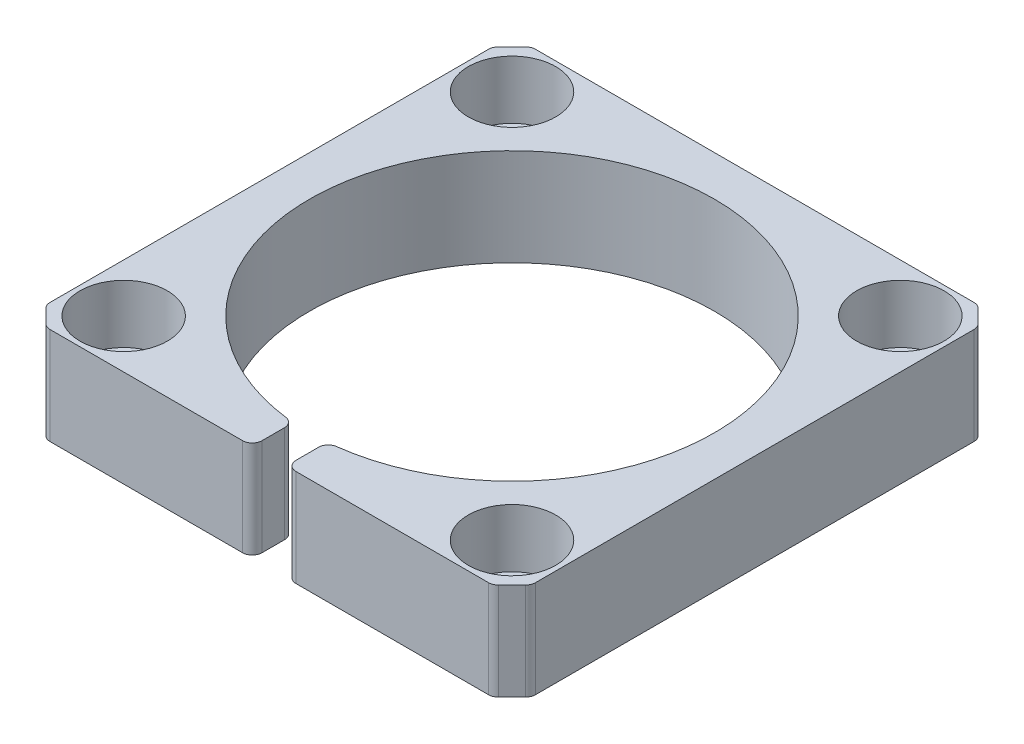
ISO-10303-21;
HEADER;
FILE_DESCRIPTION(('STEP AP214'),'2;1');
FILE_NAME('part.step','',(''),(''),'','','');
FILE_SCHEMA(('AUTOMOTIVE_DESIGN { 1 0 10303 214 1 1 1 1 }'));
ENDSEC;
DATA;
#1=APPLICATION_CONTEXT('core data for automotive mechanical design processes');
#2=APPLICATION_PROTOCOL_DEFINITION('international standard','automotive_design',2000,#1);
#3=PRODUCT_CONTEXT('',#1,'mechanical');
#4=PRODUCT('Part','Part','',(#3));
#5=PRODUCT_RELATED_PRODUCT_CATEGORY('part','',(#4));
#6=PRODUCT_DEFINITION_FORMATION('','',#4);
#7=PRODUCT_DEFINITION_CONTEXT('part definition',#1,'design');
#8=PRODUCT_DEFINITION('design','',#6,#7);
#9=PRODUCT_DEFINITION_SHAPE('','',#8);
#10=(LENGTH_UNIT() NAMED_UNIT(*) SI_UNIT(.MILLI.,.METRE.));
#11=(NAMED_UNIT(*) PLANE_ANGLE_UNIT() SI_UNIT($,.RADIAN.));
#12=(NAMED_UNIT(*) SI_UNIT($,.STERADIAN.) SOLID_ANGLE_UNIT());
#13=UNCERTAINTY_MEASURE_WITH_UNIT(LENGTH_MEASURE(1.E-05),#10,'distance_accuracy_value','');
#14=(GEOMETRIC_REPRESENTATION_CONTEXT(3) GLOBAL_UNCERTAINTY_ASSIGNED_CONTEXT((#13)) GLOBAL_UNIT_ASSIGNED_CONTEXT((#10,
#11,#12)) REPRESENTATION_CONTEXT('',''));
#15=CARTESIAN_POINT('',(0.,0.,0.));
#16=DIRECTION('',(0.,0.,1.));
#17=DIRECTION('',(1.,0.,0.));
#18=AXIS2_PLACEMENT_3D('',#15,#16,#17);
#19=CARTESIAN_POINT('',(0.,10.,0.));
#20=DIRECTION('',(0.,-1.,0.));
#21=DIRECTION('',(0.,0.,-1.));
#22=AXIS2_PLACEMENT_3D('',#19,#20,#21);
#23=PLANE('',#22);
#24=CARTESIAN_POINT('',(-20.,10.,-20.));
#25=DIRECTION('',(0.,1.,0.));
#26=DIRECTION('',(0.,0.,1.));
#27=AXIS2_PLACEMENT_3D('',#24,#25,#26);
#28=CIRCLE('',#27,4.49999999999999);
#29=CARTESIAN_POINT('',(-20.,10.,-15.5));
#30=VERTEX_POINT('',#29);
#31=EDGE_CURVE('E532',#30,#30,#28,.T.);
#32=ORIENTED_EDGE('',*,*,#31,.F.);
#33=EDGE_LOOP('',(#32));
#34=FACE_BOUND('',#33,.T.);
#35=DIRECTION('',(0.707106781186546,0.,0.707106781186549));
#36=VECTOR('',#35,1.);
#37=CARTESIAN_POINT('',(23.,10.,-25.));
#38=LINE('',#37,#36);
#39=CARTESIAN_POINT('',(24.7071067811865,10.,-23.2928932188135));
#40=VERTEX_POINT('',#39);
#41=CARTESIAN_POINT('',(23.2928932188135,10.,-24.7071067811865));
#42=VERTEX_POINT('',#41);
#43=EDGE_CURVE('E274',#40,#42,#38,.F.);
#44=ORIENTED_EDGE('',*,*,#43,.T.);
#45=CARTESIAN_POINT('',(22.5857864376269,10.,-24.));
#46=DIRECTION('',(0.,-1.,0.));
#47=DIRECTION('',(0.,0.,-1.));
#48=AXIS2_PLACEMENT_3D('',#45,#46,#47);
#49=CIRCLE('',#48,1.);
#50=CARTESIAN_POINT('',(22.5857864376269,10.,-25.));
#51=VERTEX_POINT('',#50);
#52=EDGE_CURVE('E353',#42,#51,#49,.F.);
#53=ORIENTED_EDGE('',*,*,#52,.T.);
#54=DIRECTION('',(-1.,0.,0.));
#55=VECTOR('',#54,1.);
#56=CARTESIAN_POINT('',(-25.,10.,-25.));
#57=LINE('',#56,#55);
#58=CARTESIAN_POINT('',(-22.5857864376269,10.,-25.));
#59=VERTEX_POINT('',#58);
#60=EDGE_CURVE('E228',#51,#59,#57,.T.);
#61=ORIENTED_EDGE('',*,*,#60,.T.);
#62=CARTESIAN_POINT('',(-22.5857864376269,10.,-24.));
#63=DIRECTION('',(0.,-1.,0.));
#64=DIRECTION('',(0.,0.,-1.));
#65=AXIS2_PLACEMENT_3D('',#62,#63,#64);
#66=CIRCLE('',#65,1.);
#67=CARTESIAN_POINT('',(-23.2928932188135,10.,-24.7071067811865));
#68=VERTEX_POINT('',#67);
#69=EDGE_CURVE('E337',#59,#68,#66,.F.);
#70=ORIENTED_EDGE('',*,*,#69,.T.);
#71=DIRECTION('',(0.707106781186549,0.,-0.707106781186546));
#72=VECTOR('',#71,1.);
#73=CARTESIAN_POINT('',(-25.,10.,-23.));
#74=LINE('',#73,#72);
#75=CARTESIAN_POINT('',(-24.7071067811865,10.,-23.2928932188135));
#76=VERTEX_POINT('',#75);
#77=EDGE_CURVE('E282',#68,#76,#74,.F.);
#78=ORIENTED_EDGE('',*,*,#77,.T.);
#79=CARTESIAN_POINT('',(-24.,10.,-22.5857864376269));
#80=DIRECTION('',(0.,-1.,0.));
#81=DIRECTION('',(0.,0.,-1.));
#82=AXIS2_PLACEMENT_3D('',#79,#80,#81);
#83=CIRCLE('',#82,1.);
#84=CARTESIAN_POINT('',(-25.,10.,-22.5857864376269));
#85=VERTEX_POINT('',#84);
#86=EDGE_CURVE('E334',#76,#85,#83,.F.);
#87=ORIENTED_EDGE('',*,*,#86,.T.);
#88=DIRECTION('',(0.,0.,1.));
#89=VECTOR('',#88,1.);
#90=CARTESIAN_POINT('',(-25.,10.,25.));
#91=LINE('',#90,#89);
#92=CARTESIAN_POINT('',(-25.,10.,22.5857864376269));
#93=VERTEX_POINT('',#92);
#94=EDGE_CURVE('E449',#85,#93,#91,.T.);
#95=ORIENTED_EDGE('',*,*,#94,.T.);
#96=CARTESIAN_POINT('',(-24.,10.,22.5857864376269));
#97=DIRECTION('',(0.,-1.,0.));
#98=DIRECTION('',(0.,0.,-1.));
#99=AXIS2_PLACEMENT_3D('',#96,#97,#98);
#100=CIRCLE('',#99,1.);
#101=CARTESIAN_POINT('',(-24.7071067811866,10.,23.2928932188135));
#102=VERTEX_POINT('',#101);
#103=EDGE_CURVE('E331',#93,#102,#100,.F.);
#104=ORIENTED_EDGE('',*,*,#103,.T.);
#105=DIRECTION('',(-0.707106781186546,0.,-0.707106781186549));
#106=VECTOR('',#105,1.);
#107=CARTESIAN_POINT('',(-23.,10.,25.));
#108=LINE('',#107,#106);
#109=CARTESIAN_POINT('',(-23.2928932188135,10.,24.7071067811865));
#110=VERTEX_POINT('',#109);
#111=EDGE_CURVE('E278',#102,#110,#108,.F.);
#112=ORIENTED_EDGE('',*,*,#111,.T.);
#113=CARTESIAN_POINT('',(-22.5857864376269,10.,24.));
#114=DIRECTION('',(0.,-1.,0.));
#115=DIRECTION('',(0.,0.,-1.));
#116=AXIS2_PLACEMENT_3D('',#113,#114,#115);
#117=CIRCLE('',#116,1.);
#118=CARTESIAN_POINT('',(-22.5857864376269,10.,25.));
#119=VERTEX_POINT('',#118);
#120=EDGE_CURVE('E328',#110,#119,#117,.F.);
#121=ORIENTED_EDGE('',*,*,#120,.T.);
#122=DIRECTION('',(1.,0.,0.));
#123=VECTOR('',#122,1.);
#124=CARTESIAN_POINT('',(-25.,10.,25.));
#125=LINE('',#124,#123);
#126=CARTESIAN_POINT('',(-2.75,10.,25.));
#127=VERTEX_POINT('',#126);
#128=EDGE_CURVE('E261',#119,#127,#125,.T.);
#129=ORIENTED_EDGE('',*,*,#128,.T.);
#130=CARTESIAN_POINT('',(-2.75,10.,24.));
#131=DIRECTION('',(0.,-1.,0.));
#132=DIRECTION('',(0.,0.,-1.));
#133=AXIS2_PLACEMENT_3D('',#130,#131,#132);
#134=CIRCLE('',#133,1.);
#135=CARTESIAN_POINT('',(-1.75,10.,24.));
#136=VERTEX_POINT('',#135);
#137=EDGE_CURVE('E322',#127,#136,#134,.F.);
#138=ORIENTED_EDGE('',*,*,#137,.T.);
#139=DIRECTION('',(0.,0.,1.));
#140=VECTOR('',#139,1.);
#141=CARTESIAN_POINT('',(-1.75,10.,31.0617662346977));
#142=LINE('',#141,#140);
#143=CARTESIAN_POINT('',(-1.75,10.,21.6762542889679));
#144=VERTEX_POINT('',#143);
#145=EDGE_CURVE('E427',#144,#136,#142,.T.);
#146=ORIENTED_EDGE('',*,*,#145,.F.);
#147=CARTESIAN_POINT('',(-2.75,10.,21.6762542889679));
#148=DIRECTION('',(0.,-1.,0.));
#149=DIRECTION('',(0.,0.,-1.));
#150=AXIS2_PLACEMENT_3D('',#147,#148,#149);
#151=CIRCLE('',#150,1.);
#152=CARTESIAN_POINT('',(-2.62414187643021,10.,20.6842060377566));
#153=VERTEX_POINT('',#152);
#154=EDGE_CURVE('E325',#144,#153,#151,.F.);
#155=ORIENTED_EDGE('',*,*,#154,.T.);
#156=CARTESIAN_POINT('',(0.,10.,0.));
#157=DIRECTION('',(0.,1.,0.));
#158=DIRECTION('',(0.,0.,1.));
#159=AXIS2_PLACEMENT_3D('',#156,#157,#158);
#160=CIRCLE('',#159,20.85);
#161=CARTESIAN_POINT('',(2.62414187643021,10.,20.6842060377566));
#162=VERTEX_POINT('',#161);
#163=EDGE_CURVE('E247',#162,#153,#160,.T.);
#164=ORIENTED_EDGE('',*,*,#163,.F.);
#165=CARTESIAN_POINT('',(2.75,10.,21.6762542889679));
#166=DIRECTION('',(0.,-1.,0.));
#167=DIRECTION('',(0.,0.,-1.));
#168=AXIS2_PLACEMENT_3D('',#165,#166,#167);
#169=CIRCLE('',#168,1.);
#170=CARTESIAN_POINT('',(1.75,10.,21.6762542889679));
#171=VERTEX_POINT('',#170);
#172=EDGE_CURVE('E343',#162,#171,#169,.F.);
#173=ORIENTED_EDGE('',*,*,#172,.T.);
#174=DIRECTION('',(0.,0.,-1.));
#175=VECTOR('',#174,1.);
#176=CARTESIAN_POINT('',(1.75,10.,31.0617662346977));
#177=LINE('',#176,#175);
#178=CARTESIAN_POINT('',(1.75,10.,24.));
#179=VERTEX_POINT('',#178);
#180=EDGE_CURVE('E465',#179,#171,#177,.T.);
#181=ORIENTED_EDGE('',*,*,#180,.F.);
#182=CARTESIAN_POINT('',(2.75,10.,24.));
#183=DIRECTION('',(0.,-1.,0.));
#184=DIRECTION('',(0.,0.,-1.));
#185=AXIS2_PLACEMENT_3D('',#182,#183,#184);
#186=CIRCLE('',#185,1.);
#187=CARTESIAN_POINT('',(2.75,10.,25.));
#188=VERTEX_POINT('',#187);
#189=EDGE_CURVE('E340',#179,#188,#186,.F.);
#190=ORIENTED_EDGE('',*,*,#189,.T.);
#191=CARTESIAN_POINT('',(22.5857864376269,10.,25.));
#192=VERTEX_POINT('',#191);
#193=EDGE_CURVE('E446',#188,#192,#125,.T.);
#194=ORIENTED_EDGE('',*,*,#193,.T.);
#195=CARTESIAN_POINT('',(22.5857864376269,10.,24.));
#196=DIRECTION('',(0.,-1.,0.));
#197=DIRECTION('',(0.,0.,-1.));
#198=AXIS2_PLACEMENT_3D('',#195,#196,#197);
#199=CIRCLE('',#198,1.);
#200=CARTESIAN_POINT('',(23.2928932188135,10.,24.7071067811865));
#201=VERTEX_POINT('',#200);
#202=EDGE_CURVE('E346',#192,#201,#199,.F.);
#203=ORIENTED_EDGE('',*,*,#202,.T.);
#204=DIRECTION('',(-0.707106781186549,0.,0.707106781186546));
#205=VECTOR('',#204,1.);
#206=CARTESIAN_POINT('',(25.,10.,23.));
#207=LINE('',#206,#205);
#208=CARTESIAN_POINT('',(24.7071067811865,10.,23.2928932188135));
#209=VERTEX_POINT('',#208);
#210=EDGE_CURVE('E271',#201,#209,#207,.F.);
#211=ORIENTED_EDGE('',*,*,#210,.T.);
#212=CARTESIAN_POINT('',(24.,10.,22.5857864376269));
#213=DIRECTION('',(0.,-1.,0.));
#214=DIRECTION('',(0.,0.,-1.));
#215=AXIS2_PLACEMENT_3D('',#212,#213,#214);
#216=CIRCLE('',#215,1.);
#217=CARTESIAN_POINT('',(25.,10.,22.5857864376269));
#218=VERTEX_POINT('',#217);
#219=EDGE_CURVE('E65',#209,#218,#216,.F.);
#220=ORIENTED_EDGE('',*,*,#219,.T.);
#221=DIRECTION('',(0.,0.,-1.));
#222=VECTOR('',#221,1.);
#223=CARTESIAN_POINT('',(25.,10.,25.));
#224=LINE('',#223,#222);
#225=CARTESIAN_POINT('',(25.,10.,-22.5857864376269));
#226=VERTEX_POINT('',#225);
#227=EDGE_CURVE('E255',#218,#226,#224,.T.);
#228=ORIENTED_EDGE('',*,*,#227,.T.);
#229=CARTESIAN_POINT('',(24.,10.,-22.5857864376269));
#230=DIRECTION('',(0.,-1.,0.));
#231=DIRECTION('',(0.,0.,-1.));
#232=AXIS2_PLACEMENT_3D('',#229,#230,#231);
#233=CIRCLE('',#232,1.);
#234=EDGE_CURVE('E57',#226,#40,#233,.F.);
#235=ORIENTED_EDGE('',*,*,#234,.T.);
#236=EDGE_LOOP('',(#44,#53,#61,#70,#78,#87,#95,#104,#112,#121,#129,#138,#146,#155,#164,#173,
#181,#190,#194,#203,#211,#220,#228,#235));
#237=FACE_BOUND('',#236,.T.);
#238=CARTESIAN_POINT('',(20.,10.,-20.));
#239=DIRECTION('',(0.,1.,0.));
#240=DIRECTION('',(0.,0.,1.));
#241=AXIS2_PLACEMENT_3D('',#238,#239,#240);
#242=CIRCLE('',#241,4.49999999999999);
#243=CARTESIAN_POINT('',(20.,10.,-15.5));
#244=VERTEX_POINT('',#243);
#245=EDGE_CURVE('E484',#244,#244,#242,.T.);
#246=ORIENTED_EDGE('',*,*,#245,.F.);
#247=EDGE_LOOP('',(#246));
#248=FACE_BOUND('',#247,.T.);
#249=CARTESIAN_POINT('',(20.,10.,20.));
#250=DIRECTION('',(0.,1.,0.));
#251=DIRECTION('',(0.,0.,1.));
#252=AXIS2_PLACEMENT_3D('',#249,#250,#251);
#253=CIRCLE('',#252,4.49999999999999);
#254=CARTESIAN_POINT('',(20.,10.,24.5));
#255=VERTEX_POINT('',#254);
#256=EDGE_CURVE('E500',#255,#255,#253,.T.);
#257=ORIENTED_EDGE('',*,*,#256,.F.);
#258=EDGE_LOOP('',(#257));
#259=FACE_BOUND('',#258,.T.);
#260=CARTESIAN_POINT('',(-20.,10.,20.));
#261=DIRECTION('',(0.,1.,0.));
#262=DIRECTION('',(0.,0.,1.));
#263=AXIS2_PLACEMENT_3D('',#260,#261,#262);
#264=CIRCLE('',#263,4.49999999999999);
#265=CARTESIAN_POINT('',(-20.,10.,24.5));
#266=VERTEX_POINT('',#265);
#267=EDGE_CURVE('E516',#266,#266,#264,.T.);
#268=ORIENTED_EDGE('',*,*,#267,.F.);
#269=EDGE_LOOP('',(#268));
#270=FACE_BOUND('',#269,.T.);
#271=ADVANCED_FACE('F41',(#34,#237,#248,#259,#270),#23,.F.);
#272=CARTESIAN_POINT('',(-25.,10.,25.));
#273=DIRECTION('',(0.,0.,-1.));
#274=DIRECTION('',(-1.,0.,0.));
#275=AXIS2_PLACEMENT_3D('',#272,#273,#274);
#276=PLANE('',#275);
#277=DIRECTION('',(1.,0.,0.));
#278=VECTOR('',#277,1.);
#279=CARTESIAN_POINT('',(-25.,0.,25.));
#280=LINE('',#279,#278);
#281=CARTESIAN_POINT('',(2.75,0.,25.));
#282=VERTEX_POINT('',#281);
#283=CARTESIAN_POINT('',(22.5857864376269,0.,25.));
#284=VERTEX_POINT('',#283);
#285=EDGE_CURVE('E244',#282,#284,#280,.T.);
#286=ORIENTED_EDGE('',*,*,#285,.T.);
#287=DIRECTION('',(0.,-1.,0.));
#288=VECTOR('',#287,1.);
#289=CARTESIAN_POINT('',(22.5857864376269,10.,25.));
#290=LINE('',#289,#288);
#291=EDGE_CURVE('E373',#284,#192,#290,.F.);
#292=ORIENTED_EDGE('',*,*,#291,.T.);
#293=ORIENTED_EDGE('',*,*,#193,.F.);
#294=DIRECTION('',(0.,-1.,0.));
#295=VECTOR('',#294,1.);
#296=CARTESIAN_POINT('',(2.75,10.,25.));
#297=LINE('',#296,#295);
#298=EDGE_CURVE('E369',#188,#282,#297,.T.);
#299=ORIENTED_EDGE('',*,*,#298,.T.);
#300=EDGE_LOOP('',(#286,#292,#293,#299));
#301=FACE_BOUND('',#300,.T.);
#302=ADVANCED_FACE('F540',(#301),#276,.F.);
#303=CARTESIAN_POINT('',(0.,0.,0.));
#304=DIRECTION('',(0.,-1.,0.));
#305=DIRECTION('',(0.,0.,-1.));
#306=AXIS2_PLACEMENT_3D('',#303,#304,#305);
#307=PLANE('',#306);
#308=CARTESIAN_POINT('',(-20.,0.,-20.));
#309=DIRECTION('',(0.,1.,0.));
#310=DIRECTION('',(0.,0.,1.));
#311=AXIS2_PLACEMENT_3D('',#308,#309,#310);
#312=CIRCLE('',#311,2.75000000000001);
#313=CARTESIAN_POINT('',(-20.,0.,-17.25));
#314=VERTEX_POINT('',#313);
#315=EDGE_CURVE('E520',#314,#314,#312,.T.);
#316=ORIENTED_EDGE('',*,*,#315,.T.);
#317=EDGE_LOOP('',(#316));
#318=FACE_BOUND('',#317,.T.);
#319=CARTESIAN_POINT('',(-20.,0.,20.));
#320=DIRECTION('',(0.,1.,0.));
#321=DIRECTION('',(0.,0.,1.));
#322=AXIS2_PLACEMENT_3D('',#319,#320,#321);
#323=CIRCLE('',#322,2.75000000000001);
#324=CARTESIAN_POINT('',(-20.,0.,22.75));
#325=VERTEX_POINT('',#324);
#326=EDGE_CURVE('E504',#325,#325,#323,.T.);
#327=ORIENTED_EDGE('',*,*,#326,.T.);
#328=EDGE_LOOP('',(#327));
#329=FACE_BOUND('',#328,.T.);
#330=CARTESIAN_POINT('',(20.,0.,20.));
#331=DIRECTION('',(0.,1.,0.));
#332=DIRECTION('',(0.,0.,1.));
#333=AXIS2_PLACEMENT_3D('',#330,#331,#332);
#334=CIRCLE('',#333,2.75000000000001);
#335=CARTESIAN_POINT('',(20.,0.,22.75));
#336=VERTEX_POINT('',#335);
#337=EDGE_CURVE('E488',#336,#336,#334,.T.);
#338=ORIENTED_EDGE('',*,*,#337,.T.);
#339=EDGE_LOOP('',(#338));
#340=FACE_BOUND('',#339,.T.);
#341=CARTESIAN_POINT('',(20.,0.,-20.));
#342=DIRECTION('',(0.,1.,0.));
#343=DIRECTION('',(0.,0.,1.));
#344=AXIS2_PLACEMENT_3D('',#341,#342,#343);
#345=CIRCLE('',#344,2.75000000000001);
#346=CARTESIAN_POINT('',(20.,0.,-17.25));
#347=VERTEX_POINT('',#346);
#348=EDGE_CURVE('E468',#347,#347,#345,.T.);
#349=ORIENTED_EDGE('',*,*,#348,.T.);
#350=EDGE_LOOP('',(#349));
#351=FACE_BOUND('',#350,.T.);
#352=DIRECTION('',(-1.,0.,0.));
#353=VECTOR('',#352,1.);
#354=CARTESIAN_POINT('',(-25.,0.,-25.));
#355=LINE('',#354,#353);
#356=CARTESIAN_POINT('',(22.5857864376269,0.,-25.));
#357=VERTEX_POINT('',#356);
#358=CARTESIAN_POINT('',(-22.5857864376269,0.,-25.));
#359=VERTEX_POINT('',#358);
#360=EDGE_CURVE('E225',#357,#359,#355,.T.);
#361=ORIENTED_EDGE('',*,*,#360,.F.);
#362=CARTESIAN_POINT('',(22.5857864376269,0.,-24.));
#363=DIRECTION('',(0.,-1.,0.));
#364=DIRECTION('',(0.,0.,-1.));
#365=AXIS2_PLACEMENT_3D('',#362,#363,#364);
#366=CIRCLE('',#365,1.);
#367=CARTESIAN_POINT('',(23.2928932188135,0.,-24.7071067811865));
#368=VERTEX_POINT('',#367);
#369=EDGE_CURVE('E206',#357,#368,#366,.T.);
#370=ORIENTED_EDGE('',*,*,#369,.T.);
#371=DIRECTION('',(-0.707106781186546,0.,-0.707106781186549));
#372=VECTOR('',#371,1.);
#373=CARTESIAN_POINT('',(24.,0.,-24.));
#374=LINE('',#373,#372);
#375=CARTESIAN_POINT('',(24.7071067811865,0.,-23.2928932188135));
#376=VERTEX_POINT('',#375);
#377=EDGE_CURVE('E260',#368,#376,#374,.F.);
#378=ORIENTED_EDGE('',*,*,#377,.T.);
#379=CARTESIAN_POINT('',(24.,0.,-22.5857864376269));
#380=DIRECTION('',(0.,-1.,0.));
#381=DIRECTION('',(0.,0.,-1.));
#382=AXIS2_PLACEMENT_3D('',#379,#380,#381);
#383=CIRCLE('',#382,1.);
#384=CARTESIAN_POINT('',(25.,0.,-22.5857864376269));
#385=VERTEX_POINT('',#384);
#386=EDGE_CURVE('E218',#376,#385,#383,.T.);
#387=ORIENTED_EDGE('',*,*,#386,.T.);
#388=DIRECTION('',(0.,0.,-1.));
#389=VECTOR('',#388,1.);
#390=CARTESIAN_POINT('',(25.,0.,25.));
#391=LINE('',#390,#389);
#392=CARTESIAN_POINT('',(25.,0.,22.5857864376269));
#393=VERTEX_POINT('',#392);
#394=EDGE_CURVE('E239',#393,#385,#391,.T.);
#395=ORIENTED_EDGE('',*,*,#394,.F.);
#396=CARTESIAN_POINT('',(24.,0.,22.5857864376269));
#397=DIRECTION('',(0.,-1.,0.));
#398=DIRECTION('',(0.,0.,-1.));
#399=AXIS2_PLACEMENT_3D('',#396,#397,#398);
#400=CIRCLE('',#399,1.);
#401=CARTESIAN_POINT('',(24.7071067811865,0.,23.2928932188135));
#402=VERTEX_POINT('',#401);
#403=EDGE_CURVE('E313',#393,#402,#400,.T.);
#404=ORIENTED_EDGE('',*,*,#403,.T.);
#405=DIRECTION('',(0.707106781186549,0.,-0.707106781186546));
#406=VECTOR('',#405,1.);
#407=CARTESIAN_POINT('',(24.,0.,24.));
#408=LINE('',#407,#406);
#409=CARTESIAN_POINT('',(23.2928932188135,0.,24.7071067811865));
#410=VERTEX_POINT('',#409);
#411=EDGE_CURVE('E256',#402,#410,#408,.F.);
#412=ORIENTED_EDGE('',*,*,#411,.T.);
#413=CARTESIAN_POINT('',(22.5857864376269,0.,24.));
#414=DIRECTION('',(0.,-1.,0.));
#415=DIRECTION('',(0.,0.,-1.));
#416=AXIS2_PLACEMENT_3D('',#413,#414,#415);
#417=CIRCLE('',#416,1.);
#418=EDGE_CURVE('E310',#410,#284,#417,.T.);
#419=ORIENTED_EDGE('',*,*,#418,.T.);
#420=ORIENTED_EDGE('',*,*,#285,.F.);
#421=CARTESIAN_POINT('',(2.75,0.,24.));
#422=DIRECTION('',(0.,-1.,0.));
#423=DIRECTION('',(0.,0.,-1.));
#424=AXIS2_PLACEMENT_3D('',#421,#422,#423);
#425=CIRCLE('',#424,1.);
#426=CARTESIAN_POINT('',(1.75,0.,24.));
#427=VERTEX_POINT('',#426);
#428=EDGE_CURVE('E304',#282,#427,#425,.T.);
#429=ORIENTED_EDGE('',*,*,#428,.T.);
#430=DIRECTION('',(0.,0.,-1.));
#431=VECTOR('',#430,1.);
#432=CARTESIAN_POINT('',(1.75,0.,31.0617662346977));
#433=LINE('',#432,#431);
#434=CARTESIAN_POINT('',(1.75,0.,21.6762542889679));
#435=VERTEX_POINT('',#434);
#436=EDGE_CURVE('E435',#427,#435,#433,.T.);
#437=ORIENTED_EDGE('',*,*,#436,.T.);
#438=CARTESIAN_POINT('',(2.75,0.,21.6762542889679));
#439=DIRECTION('',(0.,-1.,0.));
#440=DIRECTION('',(0.,0.,-1.));
#441=AXIS2_PLACEMENT_3D('',#438,#439,#440);
#442=CIRCLE('',#441,1.);
#443=CARTESIAN_POINT('',(2.62414187643021,0.,20.6842060377566));
#444=VERTEX_POINT('',#443);
#445=EDGE_CURVE('E307',#435,#444,#442,.T.);
#446=ORIENTED_EDGE('',*,*,#445,.T.);
#447=CARTESIAN_POINT('',(0.,0.,0.));
#448=DIRECTION('',(0.,1.,0.));
#449=DIRECTION('',(0.,0.,1.));
#450=AXIS2_PLACEMENT_3D('',#447,#448,#449);
#451=CIRCLE('',#450,20.85);
#452=CARTESIAN_POINT('',(-2.62414187643021,0.,20.6842060377566));
#453=VERTEX_POINT('',#452);
#454=EDGE_CURVE('E434',#444,#453,#451,.T.);
#455=ORIENTED_EDGE('',*,*,#454,.T.);
#456=CARTESIAN_POINT('',(-2.75,0.,21.6762542889679));
#457=DIRECTION('',(0.,-1.,0.));
#458=DIRECTION('',(0.,0.,-1.));
#459=AXIS2_PLACEMENT_3D('',#456,#457,#458);
#460=CIRCLE('',#459,1.);
#461=CARTESIAN_POINT('',(-1.75,0.,21.6762542889679));
#462=VERTEX_POINT('',#461);
#463=EDGE_CURVE('E290',#453,#462,#460,.T.);
#464=ORIENTED_EDGE('',*,*,#463,.T.);
#465=DIRECTION('',(0.,0.,1.));
#466=VECTOR('',#465,1.);
#467=CARTESIAN_POINT('',(-1.75,0.,31.0617662346977));
#468=LINE('',#467,#466);
#469=CARTESIAN_POINT('',(-1.75,0.,24.));
#470=VERTEX_POINT('',#469);
#471=EDGE_CURVE('E424',#462,#470,#468,.T.);
#472=ORIENTED_EDGE('',*,*,#471,.T.);
#473=CARTESIAN_POINT('',(-2.75,0.,24.));
#474=DIRECTION('',(0.,-1.,0.));
#475=DIRECTION('',(0.,0.,-1.));
#476=AXIS2_PLACEMENT_3D('',#473,#474,#475);
#477=CIRCLE('',#476,1.);
#478=CARTESIAN_POINT('',(-2.75,0.,25.));
#479=VERTEX_POINT('',#478);
#480=EDGE_CURVE('E230',#470,#479,#477,.T.);
#481=ORIENTED_EDGE('',*,*,#480,.T.);
#482=CARTESIAN_POINT('',(-22.5857864376269,0.,25.));
#483=VERTEX_POINT('',#482);
#484=EDGE_CURVE('E251',#483,#479,#280,.T.);
#485=ORIENTED_EDGE('',*,*,#484,.F.);
#486=CARTESIAN_POINT('',(-22.5857864376269,0.,24.));
#487=DIRECTION('',(0.,-1.,0.));
#488=DIRECTION('',(0.,0.,-1.));
#489=AXIS2_PLACEMENT_3D('',#486,#487,#488);
#490=CIRCLE('',#489,1.);
#491=CARTESIAN_POINT('',(-23.2928932188135,0.,24.7071067811865));
#492=VERTEX_POINT('',#491);
#493=EDGE_CURVE('E293',#483,#492,#490,.T.);
#494=ORIENTED_EDGE('',*,*,#493,.T.);
#495=DIRECTION('',(0.707106781186546,0.,0.707106781186549));
#496=VECTOR('',#495,1.);
#497=CARTESIAN_POINT('',(-24.,0.,24.));
#498=LINE('',#497,#496);
#499=CARTESIAN_POINT('',(-24.7071067811866,0.,23.2928932188135));
#500=VERTEX_POINT('',#499);
#501=EDGE_CURVE('E264',#492,#500,#498,.F.);
#502=ORIENTED_EDGE('',*,*,#501,.T.);
#503=CARTESIAN_POINT('',(-24.,0.,22.5857864376269));
#504=DIRECTION('',(0.,-1.,0.));
#505=DIRECTION('',(0.,0.,-1.));
#506=AXIS2_PLACEMENT_3D('',#503,#504,#505);
#507=CIRCLE('',#506,1.);
#508=CARTESIAN_POINT('',(-25.,0.,22.5857864376269));
#509=VERTEX_POINT('',#508);
#510=EDGE_CURVE('E296',#500,#509,#507,.T.);
#511=ORIENTED_EDGE('',*,*,#510,.T.);
#512=DIRECTION('',(0.,0.,1.));
#513=VECTOR('',#512,1.);
#514=CARTESIAN_POINT('',(-25.,0.,25.));
#515=LINE('',#514,#513);
#516=CARTESIAN_POINT('',(-25.,0.,-22.5857864376269));
#517=VERTEX_POINT('',#516);
#518=EDGE_CURVE('E238',#517,#509,#515,.T.);
#519=ORIENTED_EDGE('',*,*,#518,.F.);
#520=CARTESIAN_POINT('',(-24.,0.,-22.5857864376269));
#521=DIRECTION('',(0.,-1.,0.));
#522=DIRECTION('',(0.,0.,-1.));
#523=AXIS2_PLACEMENT_3D('',#520,#521,#522);
#524=CIRCLE('',#523,1.);
#525=CARTESIAN_POINT('',(-24.7071067811866,0.,-23.2928932188135));
#526=VERTEX_POINT('',#525);
#527=EDGE_CURVE('E299',#517,#526,#524,.T.);
#528=ORIENTED_EDGE('',*,*,#527,.T.);
#529=DIRECTION('',(-0.707106781186549,0.,0.707106781186546));
#530=VECTOR('',#529,1.);
#531=CARTESIAN_POINT('',(-24.,0.,-24.0000000000001));
#532=LINE('',#531,#530);
#533=CARTESIAN_POINT('',(-23.2928932188135,0.,-24.7071067811866));
#534=VERTEX_POINT('',#533);
#535=EDGE_CURVE('E268',#526,#534,#532,.F.);
#536=ORIENTED_EDGE('',*,*,#535,.T.);
#537=CARTESIAN_POINT('',(-22.5857864376269,0.,-24.));
#538=DIRECTION('',(0.,-1.,0.));
#539=DIRECTION('',(0.,0.,-1.));
#540=AXIS2_PLACEMENT_3D('',#537,#538,#539);
#541=CIRCLE('',#540,1.);
#542=EDGE_CURVE('E236',#534,#359,#541,.T.);
#543=ORIENTED_EDGE('',*,*,#542,.T.);
#544=EDGE_LOOP('',(#361,#370,#378,#387,#395,#404,#412,#419,#420,#429,#437,#446,#455,#464,#472,
#481,#485,#494,#502,#511,#519,#528,#536,#543));
#545=FACE_BOUND('',#544,.T.);
#546=ADVANCED_FACE('F233',(#318,#329,#340,#351,#545),#307,.T.);
#547=CARTESIAN_POINT('',(25.,10.,25.));
#548=DIRECTION('',(-1.,0.,0.));
#549=DIRECTION('',(0.,0.,1.));
#550=AXIS2_PLACEMENT_3D('',#547,#548,#549);
#551=PLANE('',#550);
#552=ORIENTED_EDGE('',*,*,#394,.T.);
#553=DIRECTION('',(0.,-1.,0.));
#554=VECTOR('',#553,1.);
#555=CARTESIAN_POINT('',(25.,10.,-22.5857864376269));
#556=LINE('',#555,#554);
#557=EDGE_CURVE('E360',#385,#226,#556,.F.);
#558=ORIENTED_EDGE('',*,*,#557,.T.);
#559=ORIENTED_EDGE('',*,*,#227,.F.);
#560=DIRECTION('',(0.,1.,0.));
#561=VECTOR('',#560,1.);
#562=CARTESIAN_POINT('',(25.,0.,22.5857864376269));
#563=LINE('',#562,#561);
#564=EDGE_CURVE('E356',#218,#393,#563,.F.);
#565=ORIENTED_EDGE('',*,*,#564,.T.);
#566=EDGE_LOOP('',(#552,#558,#559,#565));
#567=FACE_BOUND('',#566,.T.);
#568=ADVANCED_FACE('F552',(#567),#551,.F.);
#569=CARTESIAN_POINT('',(-25.,10.,-25.));
#570=DIRECTION('',(0.,0.,1.));
#571=DIRECTION('',(1.,0.,0.));
#572=AXIS2_PLACEMENT_3D('',#569,#570,#571);
#573=PLANE('',#572);
#574=ORIENTED_EDGE('',*,*,#60,.F.);
#575=DIRECTION('',(0.,1.,0.));
#576=VECTOR('',#575,1.);
#577=CARTESIAN_POINT('',(22.5857864376269,0.,-25.));
#578=LINE('',#577,#576);
#579=EDGE_CURVE('E210',#51,#357,#578,.F.);
#580=ORIENTED_EDGE('',*,*,#579,.T.);
#581=ORIENTED_EDGE('',*,*,#360,.T.);
#582=DIRECTION('',(0.,-1.,0.));
#583=VECTOR('',#582,1.);
#584=CARTESIAN_POINT('',(-22.5857864376269,10.,-25.));
#585=LINE('',#584,#583);
#586=EDGE_CURVE('E231',#359,#59,#585,.F.);
#587=ORIENTED_EDGE('',*,*,#586,.T.);
#588=EDGE_LOOP('',(#574,#580,#581,#587));
#589=FACE_BOUND('',#588,.T.);
#590=ADVANCED_FACE('F223',(#589),#573,.F.);
#591=CARTESIAN_POINT('',(-25.,10.,25.));
#592=DIRECTION('',(1.,0.,0.));
#593=DIRECTION('',(0.,0.,-1.));
#594=AXIS2_PLACEMENT_3D('',#591,#592,#593);
#595=PLANE('',#594);
#596=ORIENTED_EDGE('',*,*,#94,.F.);
#597=DIRECTION('',(0.,1.,0.));
#598=VECTOR('',#597,1.);
#599=CARTESIAN_POINT('',(-25.,0.,-22.5857864376269));
#600=LINE('',#599,#598);
#601=EDGE_CURVE('E400',#85,#517,#600,.F.);
#602=ORIENTED_EDGE('',*,*,#601,.T.);
#603=ORIENTED_EDGE('',*,*,#518,.T.);
#604=DIRECTION('',(0.,-1.,0.));
#605=VECTOR('',#604,1.);
#606=CARTESIAN_POINT('',(-25.,10.,22.5857864376269));
#607=LINE('',#606,#605);
#608=EDGE_CURVE('E396',#509,#93,#607,.F.);
#609=ORIENTED_EDGE('',*,*,#608,.T.);
#610=EDGE_LOOP('',(#596,#602,#603,#609));
#611=FACE_BOUND('',#610,.T.);
#612=ADVANCED_FACE('F556',(#611),#595,.F.);
#613=ORIENTED_EDGE('',*,*,#128,.F.);
#614=DIRECTION('',(0.,1.,0.));
#615=VECTOR('',#614,1.);
#616=CARTESIAN_POINT('',(-22.5857864376269,0.,25.));
#617=LINE('',#616,#615);
#618=EDGE_CURVE('E414',#119,#483,#617,.F.);
#619=ORIENTED_EDGE('',*,*,#618,.T.);
#620=ORIENTED_EDGE('',*,*,#484,.T.);
#621=DIRECTION('',(0.,1.,0.));
#622=VECTOR('',#621,1.);
#623=CARTESIAN_POINT('',(-2.75,10.,25.));
#624=LINE('',#623,#622);
#625=EDGE_CURVE('E410',#479,#127,#624,.T.);
#626=ORIENTED_EDGE('',*,*,#625,.T.);
#627=EDGE_LOOP('',(#613,#619,#620,#626));
#628=FACE_BOUND('',#627,.T.);
#629=ADVANCED_FACE('F441',(#628),#276,.F.);
#630=CARTESIAN_POINT('',(0.,10.,0.));
#631=DIRECTION('',(0.,-1.,0.));
#632=DIRECTION('',(0.,0.,-1.));
#633=AXIS2_PLACEMENT_3D('',#630,#631,#632);
#634=CYLINDRICAL_SURFACE('',#633,20.85);
#635=ORIENTED_EDGE('',*,*,#454,.F.);
#636=DIRECTION('',(0.,-1.,0.));
#637=VECTOR('',#636,1.);
#638=CARTESIAN_POINT('',(2.62414187643021,10.,20.6842060377566));
#639=LINE('',#638,#637);
#640=EDGE_CURVE('E387',#444,#162,#639,.F.);
#641=ORIENTED_EDGE('',*,*,#640,.T.);
#642=ORIENTED_EDGE('',*,*,#163,.T.);
#643=DIRECTION('',(0.,-1.,0.));
#644=VECTOR('',#643,1.);
#645=CARTESIAN_POINT('',(-2.62414187643021,10.,20.6842060377566));
#646=LINE('',#645,#644);
#647=EDGE_CURVE('E384',#153,#453,#646,.T.);
#648=ORIENTED_EDGE('',*,*,#647,.T.);
#649=EDGE_LOOP('',(#635,#641,#642,#648));
#650=FACE_BOUND('',#649,.T.);
#651=ADVANCED_FACE('F549',(#650),#634,.F.);
#652=CARTESIAN_POINT('',(-1.75,0.,31.0617662346977));
#653=DIRECTION('',(-1.,0.,0.));
#654=DIRECTION('',(0.,0.,1.));
#655=AXIS2_PLACEMENT_3D('',#652,#653,#654);
#656=PLANE('',#655);
#657=ORIENTED_EDGE('',*,*,#471,.F.);
#658=DIRECTION('',(0.,1.,0.));
#659=VECTOR('',#658,1.);
#660=CARTESIAN_POINT('',(-1.75,10.,21.6762542889679));
#661=LINE('',#660,#659);
#662=EDGE_CURVE('E11',#462,#144,#661,.T.);
#663=ORIENTED_EDGE('',*,*,#662,.T.);
#664=ORIENTED_EDGE('',*,*,#145,.T.);
#665=DIRECTION('',(0.,1.,0.));
#666=VECTOR('',#665,1.);
#667=CARTESIAN_POINT('',(-1.75,0.,24.));
#668=LINE('',#667,#666);
#669=EDGE_CURVE('E50',#136,#470,#668,.F.);
#670=ORIENTED_EDGE('',*,*,#669,.T.);
#671=EDGE_LOOP('',(#657,#663,#664,#670));
#672=FACE_BOUND('',#671,.T.);
#673=ADVANCED_FACE('F423',(#672),#656,.F.);
#674=CARTESIAN_POINT('',(1.75,0.,31.0617662346977));
#675=DIRECTION('',(1.,0.,0.));
#676=DIRECTION('',(0.,0.,-1.));
#677=AXIS2_PLACEMENT_3D('',#674,#675,#676);
#678=PLANE('',#677);
#679=ORIENTED_EDGE('',*,*,#180,.T.);
#680=DIRECTION('',(0.,1.,0.));
#681=VECTOR('',#680,1.);
#682=CARTESIAN_POINT('',(1.75,0.,21.6762542889679));
#683=LINE('',#682,#681);
#684=EDGE_CURVE('E380',#171,#435,#683,.F.);
#685=ORIENTED_EDGE('',*,*,#684,.T.);
#686=ORIENTED_EDGE('',*,*,#436,.F.);
#687=DIRECTION('',(0.,-1.,0.));
#688=VECTOR('',#687,1.);
#689=CARTESIAN_POINT('',(1.75,0.,24.));
#690=LINE('',#689,#688);
#691=EDGE_CURVE('E377',#427,#179,#690,.F.);
#692=ORIENTED_EDGE('',*,*,#691,.T.);
#693=EDGE_LOOP('',(#679,#685,#686,#692));
#694=FACE_BOUND('',#693,.T.);
#695=ADVANCED_FACE('F573',(#694),#678,.F.);
#696=CARTESIAN_POINT('',(-25.,10.,-23.));
#697=DIRECTION('',(0.707106781186546,0.,0.707106781186549));
#698=DIRECTION('',(0.,-1.,0.));
#699=AXIS2_PLACEMENT_3D('',#696,#697,#698);
#700=PLANE('',#699);
#701=ORIENTED_EDGE('',*,*,#77,.F.);
#702=DIRECTION('',(0.,1.,0.));
#703=VECTOR('',#702,1.);
#704=CARTESIAN_POINT('',(-23.2928932188135,0.,-24.7071067811865));
#705=LINE('',#704,#703);
#706=EDGE_CURVE('E393',#68,#534,#705,.F.);
#707=ORIENTED_EDGE('',*,*,#706,.T.);
#708=ORIENTED_EDGE('',*,*,#535,.F.);
#709=DIRECTION('',(0.,-1.,0.));
#710=VECTOR('',#709,1.);
#711=CARTESIAN_POINT('',(-24.7071067811865,10.,-23.2928932188135));
#712=LINE('',#711,#710);
#713=EDGE_CURVE('E390',#526,#76,#712,.F.);
#714=ORIENTED_EDGE('',*,*,#713,.T.);
#715=EDGE_LOOP('',(#701,#707,#708,#714));
#716=FACE_BOUND('',#715,.T.);
#717=ADVANCED_FACE('F566',(#716),#700,.F.);
#718=CARTESIAN_POINT('',(-23.,10.,25.));
#719=DIRECTION('',(0.707106781186549,0.,-0.707106781186546));
#720=DIRECTION('',(0.,-1.,0.));
#721=AXIS2_PLACEMENT_3D('',#718,#719,#720);
#722=PLANE('',#721);
#723=ORIENTED_EDGE('',*,*,#111,.F.);
#724=DIRECTION('',(0.,1.,0.));
#725=VECTOR('',#724,1.);
#726=CARTESIAN_POINT('',(-24.7071067811866,0.,23.2928932188135));
#727=LINE('',#726,#725);
#728=EDGE_CURVE('E407',#102,#500,#727,.F.);
#729=ORIENTED_EDGE('',*,*,#728,.T.);
#730=ORIENTED_EDGE('',*,*,#501,.F.);
#731=DIRECTION('',(0.,-1.,0.));
#732=VECTOR('',#731,1.);
#733=CARTESIAN_POINT('',(-23.2928932188135,10.,24.7071067811865));
#734=LINE('',#733,#732);
#735=EDGE_CURVE('E404',#492,#110,#734,.F.);
#736=ORIENTED_EDGE('',*,*,#735,.T.);
#737=EDGE_LOOP('',(#723,#729,#730,#736));
#738=FACE_BOUND('',#737,.T.);
#739=ADVANCED_FACE('F572',(#738),#722,.F.);
#740=CARTESIAN_POINT('',(23.,10.,-25.));
#741=DIRECTION('',(-0.707106781186549,0.,0.707106781186546));
#742=DIRECTION('',(0.,-1.,0.));
#743=AXIS2_PLACEMENT_3D('',#740,#741,#742);
#744=PLANE('',#743);
#745=ORIENTED_EDGE('',*,*,#377,.F.);
#746=DIRECTION('',(0.,-1.,0.));
#747=VECTOR('',#746,1.);
#748=CARTESIAN_POINT('',(23.2928932188135,10.,-24.7071067811865));
#749=LINE('',#748,#747);
#750=EDGE_CURVE('E211',#368,#42,#749,.F.);
#751=ORIENTED_EDGE('',*,*,#750,.T.);
#752=ORIENTED_EDGE('',*,*,#43,.F.);
#753=DIRECTION('',(0.,1.,0.));
#754=VECTOR('',#753,1.);
#755=CARTESIAN_POINT('',(24.7071067811865,0.,-23.2928932188135));
#756=LINE('',#755,#754);
#757=EDGE_CURVE('E217',#40,#376,#756,.F.);
#758=ORIENTED_EDGE('',*,*,#757,.T.);
#759=EDGE_LOOP('',(#745,#751,#752,#758));
#760=FACE_BOUND('',#759,.T.);
#761=ADVANCED_FACE('F580',(#760),#744,.F.);
#762=CARTESIAN_POINT('',(25.,10.,23.));
#763=DIRECTION('',(-0.707106781186546,0.,-0.707106781186549));
#764=DIRECTION('',(0.,-1.,0.));
#765=AXIS2_PLACEMENT_3D('',#762,#763,#764);
#766=PLANE('',#765);
#767=ORIENTED_EDGE('',*,*,#411,.F.);
#768=DIRECTION('',(0.,-1.,0.));
#769=VECTOR('',#768,1.);
#770=CARTESIAN_POINT('',(24.7071067811865,10.,23.2928932188135));
#771=LINE('',#770,#769);
#772=EDGE_CURVE('E366',#402,#209,#771,.F.);
#773=ORIENTED_EDGE('',*,*,#772,.T.);
#774=ORIENTED_EDGE('',*,*,#210,.F.);
#775=DIRECTION('',(0.,1.,0.));
#776=VECTOR('',#775,1.);
#777=CARTESIAN_POINT('',(23.2928932188135,0.,24.7071067811865));
#778=LINE('',#777,#776);
#779=EDGE_CURVE('E363',#201,#410,#778,.F.);
#780=ORIENTED_EDGE('',*,*,#779,.T.);
#781=EDGE_LOOP('',(#767,#773,#774,#780));
#782=FACE_BOUND('',#781,.T.);
#783=ADVANCED_FACE('F587',(#782),#766,.F.);
#784=CARTESIAN_POINT('',(22.5857864376269,10.,-24.));
#785=DIRECTION('',(0.,-1.,0.));
#786=DIRECTION('',(0.,0.,-1.));
#787=AXIS2_PLACEMENT_3D('',#784,#785,#786);
#788=CYLINDRICAL_SURFACE('',#787,1.);
#789=ORIENTED_EDGE('',*,*,#52,.F.);
#790=ORIENTED_EDGE('',*,*,#750,.F.);
#791=ORIENTED_EDGE('',*,*,#369,.F.);
#792=ORIENTED_EDGE('',*,*,#579,.F.);
#793=EDGE_LOOP('',(#789,#790,#791,#792));
#794=FACE_BOUND('',#793,.T.);
#795=ADVANCED_FACE('F209',(#794),#788,.T.);
#796=CARTESIAN_POINT('',(24.,10.,-22.5857864376269));
#797=DIRECTION('',(0.,1.,0.));
#798=DIRECTION('',(0.,0.,1.));
#799=AXIS2_PLACEMENT_3D('',#796,#797,#798);
#800=CYLINDRICAL_SURFACE('',#799,1.);
#801=ORIENTED_EDGE('',*,*,#386,.F.);
#802=ORIENTED_EDGE('',*,*,#757,.F.);
#803=ORIENTED_EDGE('',*,*,#234,.F.);
#804=ORIENTED_EDGE('',*,*,#557,.F.);
#805=EDGE_LOOP('',(#801,#802,#803,#804));
#806=FACE_BOUND('',#805,.T.);
#807=ADVANCED_FACE('F596',(#806),#800,.T.);
#808=CARTESIAN_POINT('',(24.,10.,22.5857864376269));
#809=DIRECTION('',(0.,-1.,0.));
#810=DIRECTION('',(0.,0.,-1.));
#811=AXIS2_PLACEMENT_3D('',#808,#809,#810);
#812=CYLINDRICAL_SURFACE('',#811,1.);
#813=ORIENTED_EDGE('',*,*,#219,.F.);
#814=ORIENTED_EDGE('',*,*,#772,.F.);
#815=ORIENTED_EDGE('',*,*,#403,.F.);
#816=ORIENTED_EDGE('',*,*,#564,.F.);
#817=EDGE_LOOP('',(#813,#814,#815,#816));
#818=FACE_BOUND('',#817,.T.);
#819=ADVANCED_FACE('F599',(#818),#812,.T.);
#820=CARTESIAN_POINT('',(22.5857864376269,10.,24.));
#821=DIRECTION('',(0.,1.,0.));
#822=DIRECTION('',(0.,0.,1.));
#823=AXIS2_PLACEMENT_3D('',#820,#821,#822);
#824=CYLINDRICAL_SURFACE('',#823,1.);
#825=ORIENTED_EDGE('',*,*,#418,.F.);
#826=ORIENTED_EDGE('',*,*,#779,.F.);
#827=ORIENTED_EDGE('',*,*,#202,.F.);
#828=ORIENTED_EDGE('',*,*,#291,.F.);
#829=EDGE_LOOP('',(#825,#826,#827,#828));
#830=FACE_BOUND('',#829,.T.);
#831=ADVANCED_FACE('F602',(#830),#824,.T.);
#832=CARTESIAN_POINT('',(2.75,10.,21.6762542889679));
#833=DIRECTION('',(0.,-1.,0.));
#834=DIRECTION('',(0.,0.,-1.));
#835=AXIS2_PLACEMENT_3D('',#832,#833,#834);
#836=CYLINDRICAL_SURFACE('',#835,1.);
#837=ORIENTED_EDGE('',*,*,#172,.F.);
#838=ORIENTED_EDGE('',*,*,#640,.F.);
#839=ORIENTED_EDGE('',*,*,#445,.F.);
#840=ORIENTED_EDGE('',*,*,#684,.F.);
#841=EDGE_LOOP('',(#837,#838,#839,#840));
#842=FACE_BOUND('',#841,.T.);
#843=ADVANCED_FACE('F606',(#842),#836,.T.);
#844=CARTESIAN_POINT('',(2.75,10.,24.));
#845=DIRECTION('',(0.,-1.,0.));
#846=DIRECTION('',(0.,0.,-1.));
#847=AXIS2_PLACEMENT_3D('',#844,#845,#846);
#848=CYLINDRICAL_SURFACE('',#847,1.);
#849=ORIENTED_EDGE('',*,*,#189,.F.);
#850=ORIENTED_EDGE('',*,*,#691,.F.);
#851=ORIENTED_EDGE('',*,*,#428,.F.);
#852=ORIENTED_EDGE('',*,*,#298,.F.);
#853=EDGE_LOOP('',(#849,#850,#851,#852));
#854=FACE_BOUND('',#853,.T.);
#855=ADVANCED_FACE('F610',(#854),#848,.T.);
#856=CARTESIAN_POINT('',(-22.5857864376269,10.,-24.));
#857=DIRECTION('',(0.,1.,0.));
#858=DIRECTION('',(0.,0.,1.));
#859=AXIS2_PLACEMENT_3D('',#856,#857,#858);
#860=CYLINDRICAL_SURFACE('',#859,1.);
#861=ORIENTED_EDGE('',*,*,#542,.F.);
#862=ORIENTED_EDGE('',*,*,#706,.F.);
#863=ORIENTED_EDGE('',*,*,#69,.F.);
#864=ORIENTED_EDGE('',*,*,#586,.F.);
#865=EDGE_LOOP('',(#861,#862,#863,#864));
#866=FACE_BOUND('',#865,.T.);
#867=ADVANCED_FACE('F614',(#866),#860,.T.);
#868=CARTESIAN_POINT('',(-24.,10.,-22.5857864376269));
#869=DIRECTION('',(0.,-1.,0.));
#870=DIRECTION('',(0.,0.,-1.));
#871=AXIS2_PLACEMENT_3D('',#868,#869,#870);
#872=CYLINDRICAL_SURFACE('',#871,1.);
#873=ORIENTED_EDGE('',*,*,#86,.F.);
#874=ORIENTED_EDGE('',*,*,#713,.F.);
#875=ORIENTED_EDGE('',*,*,#527,.F.);
#876=ORIENTED_EDGE('',*,*,#601,.F.);
#877=EDGE_LOOP('',(#873,#874,#875,#876));
#878=FACE_BOUND('',#877,.T.);
#879=ADVANCED_FACE('F618',(#878),#872,.T.);
#880=CARTESIAN_POINT('',(-24.,10.,22.5857864376269));
#881=DIRECTION('',(0.,1.,0.));
#882=DIRECTION('',(0.,0.,1.));
#883=AXIS2_PLACEMENT_3D('',#880,#881,#882);
#884=CYLINDRICAL_SURFACE('',#883,1.);
#885=ORIENTED_EDGE('',*,*,#510,.F.);
#886=ORIENTED_EDGE('',*,*,#728,.F.);
#887=ORIENTED_EDGE('',*,*,#103,.F.);
#888=ORIENTED_EDGE('',*,*,#608,.F.);
#889=EDGE_LOOP('',(#885,#886,#887,#888));
#890=FACE_BOUND('',#889,.T.);
#891=ADVANCED_FACE('F622',(#890),#884,.T.);
#892=CARTESIAN_POINT('',(-22.5857864376269,10.,24.));
#893=DIRECTION('',(0.,-1.,0.));
#894=DIRECTION('',(0.,0.,-1.));
#895=AXIS2_PLACEMENT_3D('',#892,#893,#894);
#896=CYLINDRICAL_SURFACE('',#895,1.);
#897=ORIENTED_EDGE('',*,*,#120,.F.);
#898=ORIENTED_EDGE('',*,*,#735,.F.);
#899=ORIENTED_EDGE('',*,*,#493,.F.);
#900=ORIENTED_EDGE('',*,*,#618,.F.);
#901=EDGE_LOOP('',(#897,#898,#899,#900));
#902=FACE_BOUND('',#901,.T.);
#903=ADVANCED_FACE('F626',(#902),#896,.T.);
#904=CARTESIAN_POINT('',(-2.75,10.,21.6762542889679));
#905=DIRECTION('',(0.,-1.,0.));
#906=DIRECTION('',(0.,0.,-1.));
#907=AXIS2_PLACEMENT_3D('',#904,#905,#906);
#908=CYLINDRICAL_SURFACE('',#907,1.);
#909=ORIENTED_EDGE('',*,*,#463,.F.);
#910=ORIENTED_EDGE('',*,*,#647,.F.);
#911=ORIENTED_EDGE('',*,*,#154,.F.);
#912=ORIENTED_EDGE('',*,*,#662,.F.);
#913=EDGE_LOOP('',(#909,#910,#911,#912));
#914=FACE_BOUND('',#913,.T.);
#915=ADVANCED_FACE('F629',(#914),#908,.T.);
#916=CARTESIAN_POINT('',(-2.75,10.,24.));
#917=DIRECTION('',(0.,1.,0.));
#918=DIRECTION('',(0.,0.,1.));
#919=AXIS2_PLACEMENT_3D('',#916,#917,#918);
#920=CYLINDRICAL_SURFACE('',#919,1.);
#921=ORIENTED_EDGE('',*,*,#480,.F.);
#922=ORIENTED_EDGE('',*,*,#669,.F.);
#923=ORIENTED_EDGE('',*,*,#137,.F.);
#924=ORIENTED_EDGE('',*,*,#625,.F.);
#925=EDGE_LOOP('',(#921,#922,#923,#924));
#926=FACE_BOUND('',#925,.T.);
#927=ADVANCED_FACE('F43',(#926),#920,.T.);
#928=CARTESIAN_POINT('',(20.,10.,-20.));
#929=DIRECTION('',(0.,1.,0.));
#930=DIRECTION('',(0.,0.,1.));
#931=AXIS2_PLACEMENT_3D('',#928,#929,#930);
#932=CYLINDRICAL_SURFACE('',#931,2.75);
#933=ORIENTED_EDGE('',*,*,#348,.F.);
#934=EDGE_LOOP('',(#933));
#935=FACE_BOUND('',#934,.T.);
#936=CARTESIAN_POINT('',(20.,4.,-20.));
#937=DIRECTION('',(0.,1.,0.));
#938=DIRECTION('',(0.,0.,1.));
#939=AXIS2_PLACEMENT_3D('',#936,#937,#938);
#940=CIRCLE('',#939,2.75);
#941=CARTESIAN_POINT('',(20.,4.,-17.25));
#942=VERTEX_POINT('',#941);
#943=EDGE_CURVE('E476',#942,#942,#940,.T.);
#944=ORIENTED_EDGE('',*,*,#943,.T.);
#945=EDGE_LOOP('',(#944));
#946=FACE_BOUND('',#945,.T.);
#947=ADVANCED_FACE('F636',(#935,#946),#932,.F.);
#948=CARTESIAN_POINT('',(22.75,4.,-20.));
#949=DIRECTION('',(0.,-1.,0.));
#950=DIRECTION('',(0.,0.,-1.));
#951=AXIS2_PLACEMENT_3D('',#948,#949,#950);
#952=PLANE('',#951);
#953=ORIENTED_EDGE('',*,*,#943,.F.);
#954=EDGE_LOOP('',(#953));
#955=FACE_BOUND('',#954,.T.);
#956=CARTESIAN_POINT('',(20.,4.,-20.));
#957=DIRECTION('',(0.,1.,0.));
#958=DIRECTION('',(0.,0.,1.));
#959=AXIS2_PLACEMENT_3D('',#956,#957,#958);
#960=CIRCLE('',#959,4.5);
#961=CARTESIAN_POINT('',(20.,4.,-15.5));
#962=VERTEX_POINT('',#961);
#963=EDGE_CURVE('E480',#962,#962,#960,.T.);
#964=ORIENTED_EDGE('',*,*,#963,.T.);
#965=EDGE_LOOP('',(#964));
#966=FACE_BOUND('',#965,.T.);
#967=ADVANCED_FACE('F686',(#955,#966),#952,.F.);
#968=CARTESIAN_POINT('',(20.,10.,-20.));
#969=DIRECTION('',(0.,1.,0.));
#970=DIRECTION('',(0.,0.,1.));
#971=AXIS2_PLACEMENT_3D('',#968,#969,#970);
#972=CYLINDRICAL_SURFACE('',#971,4.5);
#973=ORIENTED_EDGE('',*,*,#963,.F.);
#974=EDGE_LOOP('',(#973));
#975=FACE_BOUND('',#974,.T.);
#976=ORIENTED_EDGE('',*,*,#245,.T.);
#977=EDGE_LOOP('',(#976));
#978=FACE_BOUND('',#977,.T.);
#979=ADVANCED_FACE('F690',(#975,#978),#972,.F.);
#980=CARTESIAN_POINT('',(20.,10.,20.));
#981=DIRECTION('',(0.,1.,0.));
#982=DIRECTION('',(0.,0.,1.));
#983=AXIS2_PLACEMENT_3D('',#980,#981,#982);
#984=CYLINDRICAL_SURFACE('',#983,2.75);
#985=ORIENTED_EDGE('',*,*,#337,.F.);
#986=EDGE_LOOP('',(#985));
#987=FACE_BOUND('',#986,.T.);
#988=CARTESIAN_POINT('',(20.,4.,20.));
#989=DIRECTION('',(0.,1.,0.));
#990=DIRECTION('',(0.,0.,1.));
#991=AXIS2_PLACEMENT_3D('',#988,#989,#990);
#992=CIRCLE('',#991,2.75);
#993=CARTESIAN_POINT('',(20.,4.,22.75));
#994=VERTEX_POINT('',#993);
#995=EDGE_CURVE('E492',#994,#994,#992,.T.);
#996=ORIENTED_EDGE('',*,*,#995,.T.);
#997=EDGE_LOOP('',(#996));
#998=FACE_BOUND('',#997,.T.);
#999=ADVANCED_FACE('F694',(#987,#998),#984,.F.);
#1000=CARTESIAN_POINT('',(22.75,4.,20.));
#1001=DIRECTION('',(0.,-1.,0.));
#1002=DIRECTION('',(0.,0.,-1.));
#1003=AXIS2_PLACEMENT_3D('',#1000,#1001,#1002);
#1004=PLANE('',#1003);
#1005=ORIENTED_EDGE('',*,*,#995,.F.);
#1006=EDGE_LOOP('',(#1005));
#1007=FACE_BOUND('',#1006,.T.);
#1008=CARTESIAN_POINT('',(20.,4.,20.));
#1009=DIRECTION('',(0.,1.,0.));
#1010=DIRECTION('',(0.,0.,1.));
#1011=AXIS2_PLACEMENT_3D('',#1008,#1009,#1010);
#1012=CIRCLE('',#1011,4.5);
#1013=CARTESIAN_POINT('',(20.,4.,24.5));
#1014=VERTEX_POINT('',#1013);
#1015=EDGE_CURVE('E496',#1014,#1014,#1012,.T.);
#1016=ORIENTED_EDGE('',*,*,#1015,.T.);
#1017=EDGE_LOOP('',(#1016));
#1018=FACE_BOUND('',#1017,.T.);
#1019=ADVANCED_FACE('F698',(#1007,#1018),#1004,.F.);
#1020=CARTESIAN_POINT('',(20.,10.,20.));
#1021=DIRECTION('',(0.,1.,0.));
#1022=DIRECTION('',(0.,0.,1.));
#1023=AXIS2_PLACEMENT_3D('',#1020,#1021,#1022);
#1024=CYLINDRICAL_SURFACE('',#1023,4.5);
#1025=ORIENTED_EDGE('',*,*,#1015,.F.);
#1026=EDGE_LOOP('',(#1025));
#1027=FACE_BOUND('',#1026,.T.);
#1028=ORIENTED_EDGE('',*,*,#256,.T.);
#1029=EDGE_LOOP('',(#1028));
#1030=FACE_BOUND('',#1029,.T.);
#1031=ADVANCED_FACE('F702',(#1027,#1030),#1024,.F.);
#1032=CARTESIAN_POINT('',(-20.,10.,20.));
#1033=DIRECTION('',(0.,1.,0.));
#1034=DIRECTION('',(0.,0.,1.));
#1035=AXIS2_PLACEMENT_3D('',#1032,#1033,#1034);
#1036=CYLINDRICAL_SURFACE('',#1035,2.75);
#1037=ORIENTED_EDGE('',*,*,#326,.F.);
#1038=EDGE_LOOP('',(#1037));
#1039=FACE_BOUND('',#1038,.T.);
#1040=CARTESIAN_POINT('',(-20.,4.,20.));
#1041=DIRECTION('',(0.,1.,0.));
#1042=DIRECTION('',(0.,0.,1.));
#1043=AXIS2_PLACEMENT_3D('',#1040,#1041,#1042);
#1044=CIRCLE('',#1043,2.75);
#1045=CARTESIAN_POINT('',(-20.,4.,22.75));
#1046=VERTEX_POINT('',#1045);
#1047=EDGE_CURVE('E508',#1046,#1046,#1044,.T.);
#1048=ORIENTED_EDGE('',*,*,#1047,.T.);
#1049=EDGE_LOOP('',(#1048));
#1050=FACE_BOUND('',#1049,.T.);
#1051=ADVANCED_FACE('F706',(#1039,#1050),#1036,.F.);
#1052=CARTESIAN_POINT('',(-17.25,4.,20.));
#1053=DIRECTION('',(0.,-1.,0.));
#1054=DIRECTION('',(0.,0.,-1.));
#1055=AXIS2_PLACEMENT_3D('',#1052,#1053,#1054);
#1056=PLANE('',#1055);
#1057=ORIENTED_EDGE('',*,*,#1047,.F.);
#1058=EDGE_LOOP('',(#1057));
#1059=FACE_BOUND('',#1058,.T.);
#1060=CARTESIAN_POINT('',(-20.,4.,20.));
#1061=DIRECTION('',(0.,1.,0.));
#1062=DIRECTION('',(0.,0.,1.));
#1063=AXIS2_PLACEMENT_3D('',#1060,#1061,#1062);
#1064=CIRCLE('',#1063,4.5);
#1065=CARTESIAN_POINT('',(-20.,4.,24.5));
#1066=VERTEX_POINT('',#1065);
#1067=EDGE_CURVE('E512',#1066,#1066,#1064,.T.);
#1068=ORIENTED_EDGE('',*,*,#1067,.T.);
#1069=EDGE_LOOP('',(#1068));
#1070=FACE_BOUND('',#1069,.T.);
#1071=ADVANCED_FACE('F710',(#1059,#1070),#1056,.F.);
#1072=CARTESIAN_POINT('',(-20.,10.,20.));
#1073=DIRECTION('',(0.,1.,0.));
#1074=DIRECTION('',(0.,0.,1.));
#1075=AXIS2_PLACEMENT_3D('',#1072,#1073,#1074);
#1076=CYLINDRICAL_SURFACE('',#1075,4.5);
#1077=ORIENTED_EDGE('',*,*,#1067,.F.);
#1078=EDGE_LOOP('',(#1077));
#1079=FACE_BOUND('',#1078,.T.);
#1080=ORIENTED_EDGE('',*,*,#267,.T.);
#1081=EDGE_LOOP('',(#1080));
#1082=FACE_BOUND('',#1081,.T.);
#1083=ADVANCED_FACE('F714',(#1079,#1082),#1076,.F.);
#1084=CARTESIAN_POINT('',(-20.,10.,-20.));
#1085=DIRECTION('',(0.,1.,0.));
#1086=DIRECTION('',(0.,0.,1.));
#1087=AXIS2_PLACEMENT_3D('',#1084,#1085,#1086);
#1088=CYLINDRICAL_SURFACE('',#1087,2.75);
#1089=ORIENTED_EDGE('',*,*,#315,.F.);
#1090=EDGE_LOOP('',(#1089));
#1091=FACE_BOUND('',#1090,.T.);
#1092=CARTESIAN_POINT('',(-20.,4.,-20.));
#1093=DIRECTION('',(0.,1.,0.));
#1094=DIRECTION('',(0.,0.,1.));
#1095=AXIS2_PLACEMENT_3D('',#1092,#1093,#1094);
#1096=CIRCLE('',#1095,2.75);
#1097=CARTESIAN_POINT('',(-20.,4.,-17.25));
#1098=VERTEX_POINT('',#1097);
#1099=EDGE_CURVE('E524',#1098,#1098,#1096,.T.);
#1100=ORIENTED_EDGE('',*,*,#1099,.T.);
#1101=EDGE_LOOP('',(#1100));
#1102=FACE_BOUND('',#1101,.T.);
#1103=ADVANCED_FACE('F718',(#1091,#1102),#1088,.F.);
#1104=CARTESIAN_POINT('',(-17.25,4.,-20.));
#1105=DIRECTION('',(0.,-1.,0.));
#1106=DIRECTION('',(0.,0.,-1.));
#1107=AXIS2_PLACEMENT_3D('',#1104,#1105,#1106);
#1108=PLANE('',#1107);
#1109=ORIENTED_EDGE('',*,*,#1099,.F.);
#1110=EDGE_LOOP('',(#1109));
#1111=FACE_BOUND('',#1110,.T.);
#1112=CARTESIAN_POINT('',(-20.,4.,-20.));
#1113=DIRECTION('',(0.,1.,0.));
#1114=DIRECTION('',(0.,0.,1.));
#1115=AXIS2_PLACEMENT_3D('',#1112,#1113,#1114);
#1116=CIRCLE('',#1115,4.5);
#1117=CARTESIAN_POINT('',(-20.,4.,-15.5));
#1118=VERTEX_POINT('',#1117);
#1119=EDGE_CURVE('E528',#1118,#1118,#1116,.T.);
#1120=ORIENTED_EDGE('',*,*,#1119,.T.);
#1121=EDGE_LOOP('',(#1120));
#1122=FACE_BOUND('',#1121,.T.);
#1123=ADVANCED_FACE('F722',(#1111,#1122),#1108,.F.);
#1124=CARTESIAN_POINT('',(-20.,10.,-20.));
#1125=DIRECTION('',(0.,1.,0.));
#1126=DIRECTION('',(0.,0.,1.));
#1127=AXIS2_PLACEMENT_3D('',#1124,#1125,#1126);
#1128=CYLINDRICAL_SURFACE('',#1127,4.5);
#1129=ORIENTED_EDGE('',*,*,#1119,.F.);
#1130=EDGE_LOOP('',(#1129));
#1131=FACE_BOUND('',#1130,.T.);
#1132=ORIENTED_EDGE('',*,*,#31,.T.);
#1133=EDGE_LOOP('',(#1132));
#1134=FACE_BOUND('',#1133,.T.);
#1135=ADVANCED_FACE('F537',(#1131,#1134),#1128,.F.);
#1136=CLOSED_SHELL('',(#271,#302,#546,#568,#590,#612,#629,#651,#673,#695,#717,#739,#761,#783,
#795,#807,#819,#831,#843,#855,#867,#879,#891,#903,#915,#927,#947,#967,#979,#999,#1019,#1031,
#1051,#1071,#1083,#1103,#1123,#1135));
#1137=MANIFOLD_SOLID_BREP('B2',#1136);
#1138=ADVANCED_BREP_SHAPE_REPRESENTATION('',(#18,#1137),#14);
#1139=SHAPE_DEFINITION_REPRESENTATION(#9,#1138);
ENDSEC;
END-ISO-10303-21;
